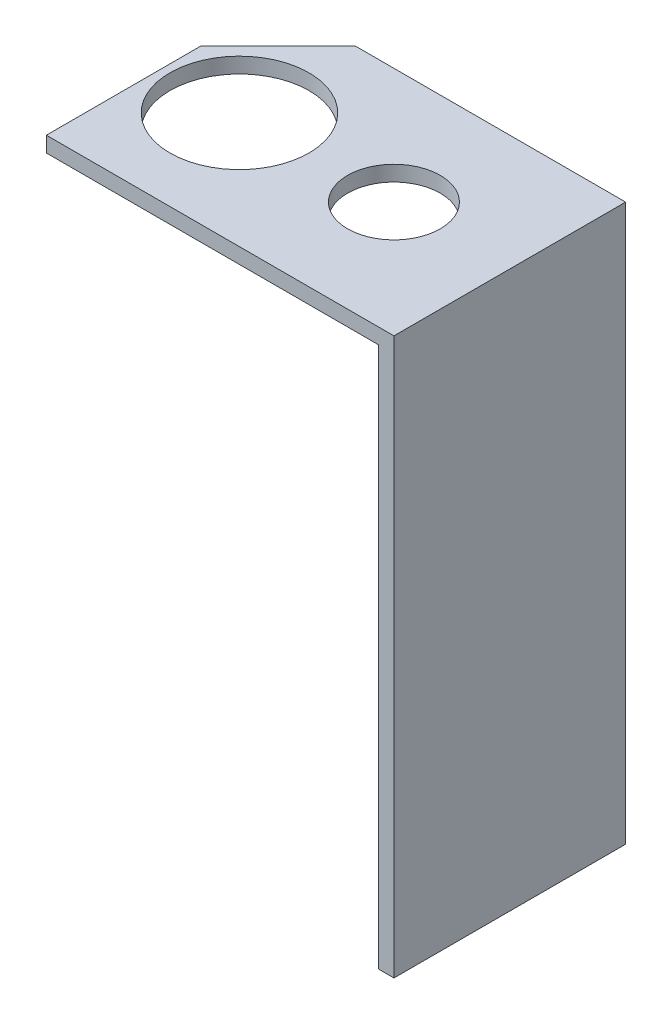
ISO-10303-21;
HEADER;
FILE_DESCRIPTION(('STEP AP214'),'2;1');
FILE_NAME('part.step','',(''),(''),'','','');
FILE_SCHEMA(('AUTOMOTIVE_DESIGN { 1 0 10303 214 1 1 1 1 }'));
ENDSEC;
DATA;
#1=APPLICATION_CONTEXT('core data for automotive mechanical design processes');
#2=APPLICATION_PROTOCOL_DEFINITION('international standard','automotive_design',2000,#1);
#3=PRODUCT_CONTEXT('',#1,'mechanical');
#4=PRODUCT('Part','Part','',(#3));
#5=PRODUCT_RELATED_PRODUCT_CATEGORY('part','',(#4));
#6=PRODUCT_DEFINITION_FORMATION('','',#4);
#7=PRODUCT_DEFINITION_CONTEXT('part definition',#1,'design');
#8=PRODUCT_DEFINITION('design','',#6,#7);
#9=PRODUCT_DEFINITION_SHAPE('','',#8);
#10=(LENGTH_UNIT() NAMED_UNIT(*) SI_UNIT(.MILLI.,.METRE.));
#11=(NAMED_UNIT(*) PLANE_ANGLE_UNIT() SI_UNIT($,.RADIAN.));
#12=(NAMED_UNIT(*) SI_UNIT($,.STERADIAN.) SOLID_ANGLE_UNIT());
#13=UNCERTAINTY_MEASURE_WITH_UNIT(LENGTH_MEASURE(1.E-05),#10,'distance_accuracy_value','');
#14=(GEOMETRIC_REPRESENTATION_CONTEXT(3) GLOBAL_UNCERTAINTY_ASSIGNED_CONTEXT((#13)) GLOBAL_UNIT_ASSIGNED_CONTEXT((#10,
#11,#12)) REPRESENTATION_CONTEXT('',''));
#15=CARTESIAN_POINT('',(0.,0.,0.));
#16=DIRECTION('',(0.,0.,1.));
#17=DIRECTION('',(1.,0.,0.));
#18=AXIS2_PLACEMENT_3D('',#15,#16,#17);
#19=CARTESIAN_POINT('',(0.,2.,0.));
#20=DIRECTION('',(1.,0.,0.));
#21=DIRECTION('',(0.,0.,-1.));
#22=AXIS2_PLACEMENT_3D('',#19,#20,#21);
#23=PLANE('',#22);
#24=DIRECTION('',(0.,0.,1.));
#25=VECTOR('',#24,1.);
#26=CARTESIAN_POINT('',(0.,2.,0.));
#27=LINE('',#26,#25);
#28=CARTESIAN_POINT('',(0.,2.,-20.));
#29=VERTEX_POINT('',#28);
#30=CARTESIAN_POINT('',(0.,2.,0.));
#31=VERTEX_POINT('',#30);
#32=EDGE_CURVE('E152',#29,#31,#27,.T.);
#33=ORIENTED_EDGE('',*,*,#32,.F.);
#34=DIRECTION('',(0.,-1.,0.));
#35=VECTOR('',#34,1.);
#36=CARTESIAN_POINT('',(0.,2.,-20.));
#37=LINE('',#36,#35);
#38=CARTESIAN_POINT('',(0.,0.,-20.));
#39=VERTEX_POINT('',#38);
#40=EDGE_CURVE('E178',#29,#39,#37,.T.);
#41=ORIENTED_EDGE('',*,*,#40,.T.);
#42=DIRECTION('',(0.,0.,1.));
#43=VECTOR('',#42,1.);
#44=CARTESIAN_POINT('',(0.,0.,0.));
#45=LINE('',#44,#43);
#46=CARTESIAN_POINT('',(0.,0.,0.));
#47=VERTEX_POINT('',#46);
#48=EDGE_CURVE('E164',#39,#47,#45,.T.);
#49=ORIENTED_EDGE('',*,*,#48,.T.);
#50=DIRECTION('',(0.,-1.,0.));
#51=VECTOR('',#50,1.);
#52=CARTESIAN_POINT('',(0.,2.,0.));
#53=LINE('',#52,#51);
#54=EDGE_CURVE('E108',#31,#47,#53,.T.);
#55=ORIENTED_EDGE('',*,*,#54,.F.);
#56=EDGE_LOOP('',(#33,#41,#49,#55));
#57=FACE_BOUND('',#56,.T.);
#58=ADVANCED_FACE('F38',(#57),#23,.F.);
#59=CARTESIAN_POINT('',(0.,2.,0.));
#60=DIRECTION('',(0.,0.,-1.));
#61=DIRECTION('',(-1.,0.,0.));
#62=AXIS2_PLACEMENT_3D('',#59,#60,#61);
#63=PLANE('',#62);
#64=DIRECTION('',(1.,0.,0.));
#65=VECTOR('',#64,1.);
#66=CARTESIAN_POINT('',(0.,0.,0.));
#67=LINE('',#66,#65);
#68=CARTESIAN_POINT('',(43.,0.,0.));
#69=VERTEX_POINT('',#68);
#70=EDGE_CURVE('E167',#47,#69,#67,.T.);
#71=ORIENTED_EDGE('',*,*,#70,.T.);
#72=DIRECTION('',(0.,1.,0.));
#73=VECTOR('',#72,1.);
#74=CARTESIAN_POINT('',(43.,-70.,0.));
#75=LINE('',#74,#73);
#76=CARTESIAN_POINT('',(43.,-70.,0.));
#77=VERTEX_POINT('',#76);
#78=EDGE_CURVE('E116',#77,#69,#75,.T.);
#79=ORIENTED_EDGE('',*,*,#78,.F.);
#80=DIRECTION('',(-1.,0.,0.));
#81=VECTOR('',#80,1.);
#82=CARTESIAN_POINT('',(45.,-70.,0.));
#83=LINE('',#82,#81);
#84=CARTESIAN_POINT('',(45.,-70.,0.));
#85=VERTEX_POINT('',#84);
#86=EDGE_CURVE('E112',#85,#77,#83,.T.);
#87=ORIENTED_EDGE('',*,*,#86,.F.);
#88=DIRECTION('',(0.,-1.,0.));
#89=VECTOR('',#88,1.);
#90=CARTESIAN_POINT('',(45.,2.,0.));
#91=LINE('',#90,#89);
#92=CARTESIAN_POINT('',(45.,2.,0.));
#93=VERTEX_POINT('',#92);
#94=EDGE_CURVE('E98',#93,#85,#91,.T.);
#95=ORIENTED_EDGE('',*,*,#94,.F.);
#96=DIRECTION('',(1.,0.,0.));
#97=VECTOR('',#96,1.);
#98=CARTESIAN_POINT('',(0.,2.,0.));
#99=LINE('',#98,#97);
#100=EDGE_CURVE('E155',#31,#93,#99,.T.);
#101=ORIENTED_EDGE('',*,*,#100,.F.);
#102=ORIENTED_EDGE('',*,*,#54,.T.);
#103=EDGE_LOOP('',(#71,#79,#87,#95,#101,#102));
#104=FACE_BOUND('',#103,.T.);
#105=ADVANCED_FACE('F114',(#104),#63,.F.);
#106=CARTESIAN_POINT('',(45.,2.,0.));
#107=DIRECTION('',(-1.,0.,0.));
#108=DIRECTION('',(0.,0.,1.));
#109=AXIS2_PLACEMENT_3D('',#106,#107,#108);
#110=PLANE('',#109);
#111=ORIENTED_EDGE('',*,*,#94,.T.);
#112=DIRECTION('',(0.,0.,1.));
#113=VECTOR('',#112,1.);
#114=CARTESIAN_POINT('',(45.,-70.,-30.));
#115=LINE('',#114,#113);
#116=CARTESIAN_POINT('',(45.,-70.,-30.));
#117=VERTEX_POINT('',#116);
#118=EDGE_CURVE('E103',#117,#85,#115,.T.);
#119=ORIENTED_EDGE('',*,*,#118,.F.);
#120=DIRECTION('',(0.,-1.,0.));
#121=VECTOR('',#120,1.);
#122=CARTESIAN_POINT('',(45.,2.,-30.));
#123=LINE('',#122,#121);
#124=CARTESIAN_POINT('',(45.,2.,-30.));
#125=VERTEX_POINT('',#124);
#126=EDGE_CURVE('E109',#125,#117,#123,.T.);
#127=ORIENTED_EDGE('',*,*,#126,.F.);
#128=DIRECTION('',(0.,0.,-1.));
#129=VECTOR('',#128,1.);
#130=CARTESIAN_POINT('',(45.,2.,0.));
#131=LINE('',#130,#129);
#132=EDGE_CURVE('E104',#93,#125,#131,.T.);
#133=ORIENTED_EDGE('',*,*,#132,.F.);
#134=EDGE_LOOP('',(#111,#119,#127,#133));
#135=FACE_BOUND('',#134,.T.);
#136=ADVANCED_FACE('F100',(#135),#110,.F.);
#137=CARTESIAN_POINT('',(0.,2.,-30.));
#138=DIRECTION('',(0.,0.,1.));
#139=DIRECTION('',(1.,0.,0.));
#140=AXIS2_PLACEMENT_3D('',#137,#138,#139);
#141=PLANE('',#140);
#142=DIRECTION('',(-1.,0.,0.));
#143=VECTOR('',#142,1.);
#144=CARTESIAN_POINT('',(0.,0.,-30.));
#145=LINE('',#144,#143);
#146=CARTESIAN_POINT('',(43.,0.,-30.));
#147=VERTEX_POINT('',#146);
#148=CARTESIAN_POINT('',(10.,0.,-30.));
#149=VERTEX_POINT('',#148);
#150=EDGE_CURVE('E156',#147,#149,#145,.T.);
#151=ORIENTED_EDGE('',*,*,#150,.T.);
#152=DIRECTION('',(0.,1.,0.));
#153=VECTOR('',#152,1.);
#154=CARTESIAN_POINT('',(10.,2.,-30.));
#155=LINE('',#154,#153);
#156=CARTESIAN_POINT('',(10.,2.,-30.));
#157=VERTEX_POINT('',#156);
#158=EDGE_CURVE('E47',#149,#157,#155,.T.);
#159=ORIENTED_EDGE('',*,*,#158,.T.);
#160=DIRECTION('',(-1.,0.,0.));
#161=VECTOR('',#160,1.);
#162=CARTESIAN_POINT('',(0.,2.,-30.));
#163=LINE('',#162,#161);
#164=EDGE_CURVE('E161',#125,#157,#163,.T.);
#165=ORIENTED_EDGE('',*,*,#164,.F.);
#166=ORIENTED_EDGE('',*,*,#126,.T.);
#167=DIRECTION('',(1.,0.,0.));
#168=VECTOR('',#167,1.);
#169=CARTESIAN_POINT('',(45.,-70.,-30.));
#170=LINE('',#169,#168);
#171=CARTESIAN_POINT('',(43.,-70.,-30.));
#172=VERTEX_POINT('',#171);
#173=EDGE_CURVE('E125',#172,#117,#170,.T.);
#174=ORIENTED_EDGE('',*,*,#173,.F.);
#175=DIRECTION('',(0.,1.,0.));
#176=VECTOR('',#175,1.);
#177=CARTESIAN_POINT('',(43.,-70.,-30.));
#178=LINE('',#177,#176);
#179=EDGE_CURVE('E136',#172,#147,#178,.T.);
#180=ORIENTED_EDGE('',*,*,#179,.T.);
#181=EDGE_LOOP('',(#151,#159,#165,#166,#174,#180));
#182=FACE_BOUND('',#181,.T.);
#183=ADVANCED_FACE('F217',(#182),#141,.F.);
#184=CARTESIAN_POINT('',(0.,2.,0.));
#185=DIRECTION('',(0.,-1.,0.));
#186=DIRECTION('',(0.,0.,-1.));
#187=AXIS2_PLACEMENT_3D('',#184,#185,#186);
#188=PLANE('',#187);
#189=CARTESIAN_POINT('',(10.,2.,-15.));
#190=DIRECTION('',(0.,1.,0.));
#191=DIRECTION('',(0.,0.,1.));
#192=AXIS2_PLACEMENT_3D('',#189,#190,#191);
#193=CIRCLE('',#192,9.00000000000001);
#194=CARTESIAN_POINT('',(10.,2.,-5.99999999999999));
#195=VERTEX_POINT('',#194);
#196=EDGE_CURVE('E144',#195,#195,#193,.T.);
#197=ORIENTED_EDGE('',*,*,#196,.F.);
#198=EDGE_LOOP('',(#197));
#199=FACE_BOUND('',#198,.T.);
#200=CARTESIAN_POINT('',(30.,2.,-15.));
#201=DIRECTION('',(0.,1.,0.));
#202=DIRECTION('',(0.,0.,1.));
#203=AXIS2_PLACEMENT_3D('',#200,#201,#202);
#204=CIRCLE('',#203,5.99999999999999);
#205=CARTESIAN_POINT('',(30.,2.,-9.00000000000001));
#206=VERTEX_POINT('',#205);
#207=EDGE_CURVE('E143',#206,#206,#204,.T.);
#208=ORIENTED_EDGE('',*,*,#207,.F.);
#209=EDGE_LOOP('',(#208));
#210=FACE_BOUND('',#209,.T.);
#211=ORIENTED_EDGE('',*,*,#164,.T.);
#212=DIRECTION('',(0.707106781186549,0.,-0.707106781186547));
#213=VECTOR('',#212,1.);
#214=CARTESIAN_POINT('',(0.,2.,-20.));
#215=LINE('',#214,#213);
#216=EDGE_CURVE('E11',#157,#29,#215,.F.);
#217=ORIENTED_EDGE('',*,*,#216,.T.);
#218=ORIENTED_EDGE('',*,*,#32,.T.);
#219=ORIENTED_EDGE('',*,*,#100,.T.);
#220=ORIENTED_EDGE('',*,*,#132,.T.);
#221=EDGE_LOOP('',(#211,#217,#218,#219,#220));
#222=FACE_BOUND('',#221,.T.);
#223=ADVANCED_FACE('F200',(#199,#210,#222),#188,.F.);
#224=CARTESIAN_POINT('',(0.,0.,0.));
#225=DIRECTION('',(0.,-1.,0.));
#226=DIRECTION('',(0.,0.,-1.));
#227=AXIS2_PLACEMENT_3D('',#224,#225,#226);
#228=PLANE('',#227);
#229=ORIENTED_EDGE('',*,*,#48,.F.);
#230=DIRECTION('',(-0.707106781186549,0.,0.707106781186547));
#231=VECTOR('',#230,1.);
#232=CARTESIAN_POINT('',(-10.,0.,-10.));
#233=LINE('',#232,#231);
#234=EDGE_CURVE('E61',#39,#149,#233,.F.);
#235=ORIENTED_EDGE('',*,*,#234,.T.);
#236=ORIENTED_EDGE('',*,*,#150,.F.);
#237=DIRECTION('',(0.,0.,-1.));
#238=VECTOR('',#237,1.);
#239=CARTESIAN_POINT('',(43.,0.,-30.));
#240=LINE('',#239,#238);
#241=EDGE_CURVE('E127',#69,#147,#240,.T.);
#242=ORIENTED_EDGE('',*,*,#241,.F.);
#243=ORIENTED_EDGE('',*,*,#70,.F.);
#244=EDGE_LOOP('',(#229,#235,#236,#242,#243));
#245=FACE_BOUND('',#244,.T.);
#246=CARTESIAN_POINT('',(10.,0.,-15.));
#247=DIRECTION('',(0.,-1.,0.));
#248=DIRECTION('',(0.,0.,-1.));
#249=AXIS2_PLACEMENT_3D('',#246,#247,#248);
#250=CIRCLE('',#249,9.00000000000001);
#251=CARTESIAN_POINT('',(10.,0.,-24.));
#252=VERTEX_POINT('',#251);
#253=EDGE_CURVE('E168',#252,#252,#250,.T.);
#254=ORIENTED_EDGE('',*,*,#253,.F.);
#255=EDGE_LOOP('',(#254));
#256=FACE_BOUND('',#255,.T.);
#257=CARTESIAN_POINT('',(30.,0.,-15.));
#258=DIRECTION('',(0.,-1.,0.));
#259=DIRECTION('',(0.,0.,-1.));
#260=AXIS2_PLACEMENT_3D('',#257,#258,#259);
#261=CIRCLE('',#260,5.99999999999999);
#262=CARTESIAN_POINT('',(30.,0.,-21.));
#263=VERTEX_POINT('',#262);
#264=EDGE_CURVE('E148',#263,#263,#261,.T.);
#265=ORIENTED_EDGE('',*,*,#264,.F.);
#266=EDGE_LOOP('',(#265));
#267=FACE_BOUND('',#266,.T.);
#268=ADVANCED_FACE('F197',(#245,#256,#267),#228,.T.);
#269=CARTESIAN_POINT('',(30.,-18.,-15.));
#270=DIRECTION('',(0.,1.,0.));
#271=DIRECTION('',(0.,0.,1.));
#272=AXIS2_PLACEMENT_3D('',#269,#270,#271);
#273=CYLINDRICAL_SURFACE('',#272,5.99999999999999);
#274=ORIENTED_EDGE('',*,*,#264,.T.);
#275=EDGE_LOOP('',(#274));
#276=FACE_BOUND('',#275,.T.);
#277=ORIENTED_EDGE('',*,*,#207,.T.);
#278=EDGE_LOOP('',(#277));
#279=FACE_BOUND('',#278,.T.);
#280=ADVANCED_FACE('F221',(#276,#279),#273,.F.);
#281=CARTESIAN_POINT('',(10.,-18.,-15.));
#282=DIRECTION('',(0.,1.,0.));
#283=DIRECTION('',(0.,0.,1.));
#284=AXIS2_PLACEMENT_3D('',#281,#282,#283);
#285=CYLINDRICAL_SURFACE('',#284,9.00000000000001);
#286=ORIENTED_EDGE('',*,*,#253,.T.);
#287=EDGE_LOOP('',(#286));
#288=FACE_BOUND('',#287,.T.);
#289=ORIENTED_EDGE('',*,*,#196,.T.);
#290=EDGE_LOOP('',(#289));
#291=FACE_BOUND('',#290,.T.);
#292=ADVANCED_FACE('F227',(#288,#291),#285,.F.);
#293=CARTESIAN_POINT('',(43.,-70.,-30.));
#294=DIRECTION('',(1.,0.,0.));
#295=DIRECTION('',(0.,0.,-1.));
#296=AXIS2_PLACEMENT_3D('',#293,#294,#295);
#297=PLANE('',#296);
#298=ORIENTED_EDGE('',*,*,#241,.T.);
#299=ORIENTED_EDGE('',*,*,#179,.F.);
#300=DIRECTION('',(0.,0.,-1.));
#301=VECTOR('',#300,1.);
#302=CARTESIAN_POINT('',(43.,-70.,-30.));
#303=LINE('',#302,#301);
#304=EDGE_CURVE('E120',#77,#172,#303,.T.);
#305=ORIENTED_EDGE('',*,*,#304,.F.);
#306=ORIENTED_EDGE('',*,*,#78,.T.);
#307=EDGE_LOOP('',(#298,#299,#305,#306));
#308=FACE_BOUND('',#307,.T.);
#309=ADVANCED_FACE('F205',(#308),#297,.F.);
#310=CARTESIAN_POINT('',(0.,-70.,0.));
#311=DIRECTION('',(0.,-1.,0.));
#312=DIRECTION('',(0.,0.,-1.));
#313=AXIS2_PLACEMENT_3D('',#310,#311,#312);
#314=PLANE('',#313);
#315=ORIENTED_EDGE('',*,*,#118,.T.);
#316=ORIENTED_EDGE('',*,*,#86,.T.);
#317=ORIENTED_EDGE('',*,*,#304,.T.);
#318=ORIENTED_EDGE('',*,*,#173,.T.);
#319=EDGE_LOOP('',(#315,#316,#317,#318));
#320=FACE_BOUND('',#319,.T.);
#321=ADVANCED_FACE('F123',(#320),#314,.T.);
#322=CARTESIAN_POINT('',(0.,2.,-20.));
#323=DIRECTION('',(0.707106781186546,0.,0.707106781186548));
#324=DIRECTION('',(0.,-1.,0.));
#325=AXIS2_PLACEMENT_3D('',#322,#323,#324);
#326=PLANE('',#325);
#327=ORIENTED_EDGE('',*,*,#216,.F.);
#328=ORIENTED_EDGE('',*,*,#158,.F.);
#329=ORIENTED_EDGE('',*,*,#234,.F.);
#330=ORIENTED_EDGE('',*,*,#40,.F.);
#331=EDGE_LOOP('',(#327,#328,#329,#330));
#332=FACE_BOUND('',#331,.T.);
#333=ADVANCED_FACE('F40',(#332),#326,.F.);
#334=CLOSED_SHELL('',(#58,#105,#136,#183,#223,#268,#280,#292,#309,#321,#333));
#335=MANIFOLD_SOLID_BREP('B2',#334);
#336=ADVANCED_BREP_SHAPE_REPRESENTATION('',(#18,#335),#14);
#337=SHAPE_DEFINITION_REPRESENTATION(#9,#336);
ENDSEC;
END-ISO-10303-21;
